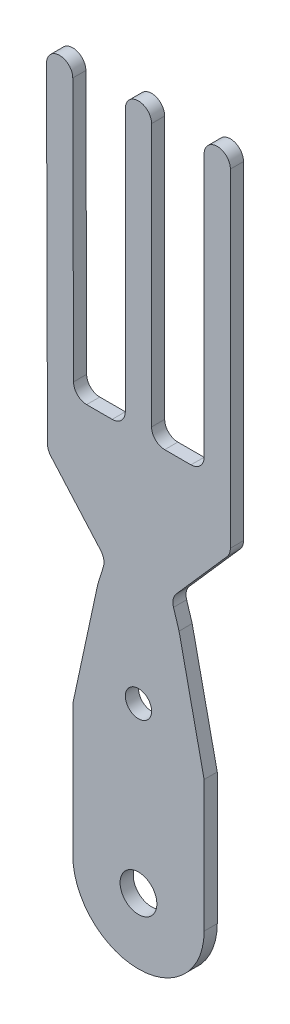
ISO-10303-21;
HEADER;
FILE_DESCRIPTION(('STEP AP214'),'2;1');
FILE_NAME('part.step','',(''),(''),'','','');
FILE_SCHEMA(('AUTOMOTIVE_DESIGN { 1 0 10303 214 1 1 1 1 }'));
ENDSEC;
DATA;
#1=APPLICATION_CONTEXT('core data for automotive mechanical design processes');
#2=APPLICATION_PROTOCOL_DEFINITION('international standard','automotive_design',2000,#1);
#3=PRODUCT_CONTEXT('',#1,'mechanical');
#4=PRODUCT('Part','Part','',(#3));
#5=PRODUCT_RELATED_PRODUCT_CATEGORY('part','',(#4));
#6=PRODUCT_DEFINITION_FORMATION('','',#4);
#7=PRODUCT_DEFINITION_CONTEXT('part definition',#1,'design');
#8=PRODUCT_DEFINITION('design','',#6,#7);
#9=PRODUCT_DEFINITION_SHAPE('','',#8);
#10=(LENGTH_UNIT() NAMED_UNIT(*) SI_UNIT(.MILLI.,.METRE.));
#11=(NAMED_UNIT(*) PLANE_ANGLE_UNIT() SI_UNIT($,.RADIAN.));
#12=(NAMED_UNIT(*) SI_UNIT($,.STERADIAN.) SOLID_ANGLE_UNIT());
#13=UNCERTAINTY_MEASURE_WITH_UNIT(LENGTH_MEASURE(1.E-05),#10,'distance_accuracy_value','');
#14=(GEOMETRIC_REPRESENTATION_CONTEXT(3) GLOBAL_UNCERTAINTY_ASSIGNED_CONTEXT((#13)) GLOBAL_UNIT_ASSIGNED_CONTEXT((#10,
#11,#12)) REPRESENTATION_CONTEXT('',''));
#15=CARTESIAN_POINT('',(0.,0.,0.));
#16=DIRECTION('',(0.,0.,1.));
#17=DIRECTION('',(1.,0.,0.));
#18=AXIS2_PLACEMENT_3D('',#15,#16,#17);
#19=CARTESIAN_POINT('',(51.2059903999994,33.8532621450006,-1.));
#20=DIRECTION('',(0.,0.,1.));
#21=DIRECTION('',(1.,0.,0.));
#22=AXIS2_PLACEMENT_3D('',#19,#20,#21);
#23=CYLINDRICAL_SURFACE('',#22,1.);
#24=CARTESIAN_POINT('',(51.2059903999994,33.8532621450006,0.));
#25=DIRECTION('',(0.,0.,1.));
#26=DIRECTION('',(1.,0.,0.));
#27=AXIS2_PLACEMENT_3D('',#24,#25,#26);
#28=CIRCLE('',#27,1.);
#29=CARTESIAN_POINT('',(52.2059903999994,33.8532621450006,0.));
#30=VERTEX_POINT('',#29);
#31=CARTESIAN_POINT('',(50.2059903999994,33.8532621450006,0.));
#32=VERTEX_POINT('',#31);
#33=EDGE_CURVE('E256',#30,#32,#28,.T.);
#34=ORIENTED_EDGE('',*,*,#33,.F.);
#35=DIRECTION('',(0.,0.,1.));
#36=VECTOR('',#35,1.);
#37=CARTESIAN_POINT('',(52.2059903999994,33.8532621450006,-1.));
#38=LINE('',#37,#36);
#39=CARTESIAN_POINT('',(52.2059903999994,33.8532621450006,-1.));
#40=VERTEX_POINT('',#39);
#41=EDGE_CURVE('E11',#40,#30,#38,.T.);
#42=ORIENTED_EDGE('',*,*,#41,.F.);
#43=CARTESIAN_POINT('',(51.2059903999994,33.8532621450006,-1.));
#44=DIRECTION('',(0.,0.,1.));
#45=DIRECTION('',(1.,0.,0.));
#46=AXIS2_PLACEMENT_3D('',#43,#44,#45);
#47=CIRCLE('',#46,1.);
#48=CARTESIAN_POINT('',(50.2059903999994,33.8532621450006,-1.));
#49=VERTEX_POINT('',#48);
#50=EDGE_CURVE('E337',#40,#49,#47,.T.);
#51=ORIENTED_EDGE('',*,*,#50,.T.);
#52=DIRECTION('',(0.,0.,1.));
#53=VECTOR('',#52,1.);
#54=CARTESIAN_POINT('',(50.2059903999994,33.8532621450006,-1.));
#55=LINE('',#54,#53);
#56=EDGE_CURVE('E42',#49,#32,#55,.T.);
#57=ORIENTED_EDGE('',*,*,#56,.T.);
#58=EDGE_LOOP('',(#34,#42,#51,#57));
#59=FACE_BOUND('',#58,.T.);
#60=ADVANCED_FACE('F39',(#59),#23,.T.);
#61=CARTESIAN_POINT('',(52.2059903999994,33.8532621450006,-1.));
#62=DIRECTION('',(1.,0.,0.));
#63=DIRECTION('',(0.,0.,-1.));
#64=AXIS2_PLACEMENT_3D('',#61,#62,#63);
#65=PLANE('',#64);
#66=DIRECTION('',(0.,1.,0.));
#67=VECTOR('',#66,1.);
#68=CARTESIAN_POINT('',(52.2059903999994,33.8532621450006,0.));
#69=LINE('',#68,#67);
#70=CARTESIAN_POINT('',(52.2059903999994,8.85490956684443,0.));
#71=VERTEX_POINT('',#70);
#72=EDGE_CURVE('E335',#71,#30,#69,.T.);
#73=ORIENTED_EDGE('',*,*,#72,.F.);
#74=DIRECTION('',(0.,0.,1.));
#75=VECTOR('',#74,1.);
#76=CARTESIAN_POINT('',(52.2059903999994,8.85490956684443,-1.));
#77=LINE('',#76,#75);
#78=CARTESIAN_POINT('',(52.2059903999994,8.85490956684443,-1.));
#79=VERTEX_POINT('',#78);
#80=EDGE_CURVE('E48',#79,#71,#77,.T.);
#81=ORIENTED_EDGE('',*,*,#80,.F.);
#82=DIRECTION('',(0.,1.,0.));
#83=VECTOR('',#82,1.);
#84=CARTESIAN_POINT('',(52.2059903999994,33.8532621450006,-1.));
#85=LINE('',#84,#83);
#86=EDGE_CURVE('E246',#79,#40,#85,.T.);
#87=ORIENTED_EDGE('',*,*,#86,.T.);
#88=ORIENTED_EDGE('',*,*,#41,.T.);
#89=EDGE_LOOP('',(#73,#81,#87,#88));
#90=FACE_BOUND('',#89,.T.);
#91=ADVANCED_FACE('F389',(#90),#65,.T.);
#92=CARTESIAN_POINT('',(51.171383471131,8.85490956684508,-1.));
#93=DIRECTION('',(0.,0.,1.));
#94=DIRECTION('',(1.,0.,0.));
#95=AXIS2_PLACEMENT_3D('',#92,#93,#94);
#96=CYLINDRICAL_SURFACE('',#95,1.03460692886839);
#97=CARTESIAN_POINT('',(51.171383471131,8.85490956684508,0.));
#98=DIRECTION('',(0.,0.,1.));
#99=DIRECTION('',(1.,0.,0.));
#100=AXIS2_PLACEMENT_3D('',#97,#98,#99);
#101=CIRCLE('',#100,1.03460692886839);
#102=CARTESIAN_POINT('',(51.948138548908,8.17148945709553,0.));
#103=VERTEX_POINT('',#102);
#104=EDGE_CURVE('E233',#103,#71,#101,.T.);
#105=ORIENTED_EDGE('',*,*,#104,.F.);
#106=DIRECTION('',(0.,0.,1.));
#107=VECTOR('',#106,1.);
#108=CARTESIAN_POINT('',(51.948138548908,8.17148945709553,-1.));
#109=LINE('',#108,#107);
#110=CARTESIAN_POINT('',(51.948138548908,8.17148945709553,-1.));
#111=VERTEX_POINT('',#110);
#112=EDGE_CURVE('E228',#111,#103,#109,.T.);
#113=ORIENTED_EDGE('',*,*,#112,.F.);
#114=CARTESIAN_POINT('',(51.171383471131,8.85490956684508,-1.));
#115=DIRECTION('',(0.,0.,1.));
#116=DIRECTION('',(1.,0.,0.));
#117=AXIS2_PLACEMENT_3D('',#114,#115,#116);
#118=CIRCLE('',#117,1.03460692886839);
#119=EDGE_CURVE('E231',#111,#79,#118,.T.);
#120=ORIENTED_EDGE('',*,*,#119,.T.);
#121=ORIENTED_EDGE('',*,*,#80,.T.);
#122=EDGE_LOOP('',(#105,#113,#120,#121));
#123=FACE_BOUND('',#122,.T.);
#124=ADVANCED_FACE('F230',(#123),#96,.T.);
#125=CARTESIAN_POINT('',(51.948138548908,8.17148945709553,-1.));
#126=DIRECTION('',(0.750773125622314,-0.660560151570847,0.));
#127=DIRECTION('',(0.660560151570847,0.750773125622314,0.));
#128=AXIS2_PLACEMENT_3D('',#125,#126,#127);
#129=PLANE('',#128);
#130=DIRECTION('',(0.660560151570847,0.750773125622314,0.));
#131=VECTOR('',#130,1.);
#132=CARTESIAN_POINT('',(51.948138548908,8.17148945709553,0.));
#133=LINE('',#132,#131);
#134=CARTESIAN_POINT('',(48.0874459509376,3.78354046872203,0.));
#135=VERTEX_POINT('',#134);
#136=EDGE_CURVE('E332',#135,#103,#133,.T.);
#137=ORIENTED_EDGE('',*,*,#136,.F.);
#138=DIRECTION('',(0.,0.,1.));
#139=VECTOR('',#138,1.);
#140=CARTESIAN_POINT('',(48.0874459509376,3.78354046872203,-1.));
#141=LINE('',#140,#139);
#142=CARTESIAN_POINT('',(48.0874459509376,3.78354046872203,-1.));
#143=VERTEX_POINT('',#142);
#144=EDGE_CURVE('E238',#143,#135,#141,.T.);
#145=ORIENTED_EDGE('',*,*,#144,.F.);
#146=DIRECTION('',(0.660560151570847,0.750773125622314,0.));
#147=VECTOR('',#146,1.);
#148=CARTESIAN_POINT('',(51.948138548908,8.17148945709553,-1.));
#149=LINE('',#148,#147);
#150=EDGE_CURVE('E244',#143,#111,#149,.T.);
#151=ORIENTED_EDGE('',*,*,#150,.T.);
#152=ORIENTED_EDGE('',*,*,#112,.T.);
#153=EDGE_LOOP('',(#137,#145,#151,#152));
#154=FACE_BOUND('',#153,.T.);
#155=ADVANCED_FACE('F248',(#154),#129,.T.);
#156=CARTESIAN_POINT('',(48.8642010287147,3.10012035897242,-1.));
#157=DIRECTION('',(0.,0.,1.));
#158=DIRECTION('',(1.,0.,0.));
#159=AXIS2_PLACEMENT_3D('',#156,#157,#158);
#160=CYLINDRICAL_SURFACE('',#159,1.03460692886847);
#161=CARTESIAN_POINT('',(48.8642010287147,3.10012035897242,0.));
#162=DIRECTION('',(0.,0.,-1.));
#163=DIRECTION('',(1.,0.,0.));
#164=AXIS2_PLACEMENT_3D('',#161,#162,#163);
#165=CIRCLE('',#164,1.03460692886847);
#166=CARTESIAN_POINT('',(47.8763878636981,2.79248965783455,0.));
#167=VERTEX_POINT('',#166);
#168=EDGE_CURVE('E329',#167,#135,#165,.T.);
#169=ORIENTED_EDGE('',*,*,#168,.F.);
#170=DIRECTION('',(0.,0.,1.));
#171=VECTOR('',#170,1.);
#172=CARTESIAN_POINT('',(47.8763878636981,2.79248965783455,-1.));
#173=LINE('',#172,#171);
#174=CARTESIAN_POINT('',(47.8763878636981,2.79248965783455,-1.));
#175=VERTEX_POINT('',#174);
#176=EDGE_CURVE('E341',#175,#167,#173,.T.);
#177=ORIENTED_EDGE('',*,*,#176,.F.);
#178=CARTESIAN_POINT('',(48.8642010287147,3.10012035897242,-1.));
#179=DIRECTION('',(0.,0.,-1.));
#180=DIRECTION('',(1.,0.,0.));
#181=AXIS2_PLACEMENT_3D('',#178,#179,#180);
#182=CIRCLE('',#181,1.03460692886847);
#183=EDGE_CURVE('E249',#175,#143,#182,.T.);
#184=ORIENTED_EDGE('',*,*,#183,.T.);
#185=ORIENTED_EDGE('',*,*,#144,.T.);
#186=EDGE_LOOP('',(#169,#177,#184,#185));
#187=FACE_BOUND('',#186,.T.);
#188=ADVANCED_FACE('F402',(#187),#160,.F.);
#189=CARTESIAN_POINT('',(47.8763878636981,2.79248965783455,-1.));
#190=DIRECTION('',(0.954771457114567,0.29734065426599,0.));
#191=DIRECTION('',(-0.29734065426599,0.954771457114567,0.));
#192=AXIS2_PLACEMENT_3D('',#189,#190,#191);
#193=PLANE('',#192);
#194=DIRECTION('',(-0.29734065426599,0.954771457114567,0.));
#195=VECTOR('',#194,1.);
#196=CARTESIAN_POINT('',(47.8763878636981,2.79248965783455,0.));
#197=LINE('',#196,#195);
#198=CARTESIAN_POINT('',(48.2987110169203,1.43639493419007,0.));
#199=VERTEX_POINT('',#198);
#200=EDGE_CURVE('E326',#199,#167,#197,.T.);
#201=ORIENTED_EDGE('',*,*,#200,.F.);
#202=DIRECTION('',(0.,0.,1.));
#203=VECTOR('',#202,1.);
#204=CARTESIAN_POINT('',(48.2987110169203,1.43639493419007,-1.));
#205=LINE('',#204,#203);
#206=CARTESIAN_POINT('',(48.2987110169203,1.43639493419007,-1.));
#207=VERTEX_POINT('',#206);
#208=EDGE_CURVE('E343',#207,#199,#205,.T.);
#209=ORIENTED_EDGE('',*,*,#208,.F.);
#210=DIRECTION('',(-0.29734065426599,0.954771457114567,0.));
#211=VECTOR('',#210,1.);
#212=CARTESIAN_POINT('',(47.8763878636981,2.79248965783455,-1.));
#213=LINE('',#212,#211);
#214=EDGE_CURVE('E251',#207,#175,#213,.T.);
#215=ORIENTED_EDGE('',*,*,#214,.T.);
#216=ORIENTED_EDGE('',*,*,#176,.T.);
#217=EDGE_LOOP('',(#201,#209,#215,#216));
#218=FACE_BOUND('',#217,.T.);
#219=ADVANCED_FACE('F405',(#218),#193,.T.);
#220=CARTESIAN_POINT('',(50.2074370744616,-7.3916991490481,-1.));
#221=DIRECTION('',(0.977415332722203,0.211327393774553,0.));
#222=DIRECTION('',(-0.211327393774553,0.977415332722203,0.));
#223=AXIS2_PLACEMENT_3D('',#220,#221,#222);
#224=PLANE('',#223);
#225=DIRECTION('',(-0.211327393774553,0.977415332722203,0.));
#226=VECTOR('',#225,1.);
#227=CARTESIAN_POINT('',(50.2074370744616,-7.3916991490481,0.));
#228=LINE('',#227,#226);
#229=CARTESIAN_POINT('',(50.2074370744616,-7.3916991490481,0.));
#230=VERTEX_POINT('',#229);
#231=EDGE_CURVE('E323',#230,#199,#228,.T.);
#232=ORIENTED_EDGE('',*,*,#231,.F.);
#233=DIRECTION('',(0.,0.,1.));
#234=VECTOR('',#233,1.);
#235=CARTESIAN_POINT('',(50.2074370744616,-7.3916991490481,-1.));
#236=LINE('',#235,#234);
#237=CARTESIAN_POINT('',(50.2074370744616,-7.3916991490481,-1.));
#238=VERTEX_POINT('',#237);
#239=EDGE_CURVE('E345',#238,#230,#236,.T.);
#240=ORIENTED_EDGE('',*,*,#239,.F.);
#241=DIRECTION('',(-0.211327393774553,0.977415332722203,0.));
#242=VECTOR('',#241,1.);
#243=CARTESIAN_POINT('',(50.2074370744616,-7.3916991490481,-1.));
#244=LINE('',#243,#242);
#245=EDGE_CURVE('E591',#238,#207,#244,.T.);
#246=ORIENTED_EDGE('',*,*,#245,.T.);
#247=ORIENTED_EDGE('',*,*,#208,.T.);
#248=EDGE_LOOP('',(#232,#240,#246,#247));
#249=FACE_BOUND('',#248,.T.);
#250=ADVANCED_FACE('F409',(#249),#224,.T.);
#251=CARTESIAN_POINT('',(50.2074370744616,-7.3916991490481,-1.));
#252=DIRECTION('',(0.999999990495723,0.000137871512091449,0.));
#253=DIRECTION('',(-0.000137871512091449,0.999999990495723,0.));
#254=AXIS2_PLACEMENT_3D('',#251,#252,#253);
#255=PLANE('',#254);
#256=DIRECTION('',(-0.000137871512091449,0.999999990495723,0.));
#257=VECTOR('',#256,1.);
#258=CARTESIAN_POINT('',(50.2074370744616,-7.3916991490481,0.));
#259=LINE('',#258,#257);
#260=CARTESIAN_POINT('',(50.208815979668,-17.393077769126,0.));
#261=VERTEX_POINT('',#260);
#262=EDGE_CURVE('E320',#261,#230,#259,.T.);
#263=ORIENTED_EDGE('',*,*,#262,.F.);
#264=DIRECTION('',(0.,0.,1.));
#265=VECTOR('',#264,1.);
#266=CARTESIAN_POINT('',(50.208815979668,-17.393077769126,-1.));
#267=LINE('',#266,#265);
#268=CARTESIAN_POINT('',(50.208815979668,-17.393077769126,-1.));
#269=VERTEX_POINT('',#268);
#270=EDGE_CURVE('E347',#269,#261,#267,.T.);
#271=ORIENTED_EDGE('',*,*,#270,.F.);
#272=DIRECTION('',(-0.000137871512091449,0.999999990495723,0.));
#273=VECTOR('',#272,1.);
#274=CARTESIAN_POINT('',(50.2074370744616,-7.3916991490481,-1.));
#275=LINE('',#274,#273);
#276=EDGE_CURVE('E588',#269,#238,#275,.T.);
#277=ORIENTED_EDGE('',*,*,#276,.T.);
#278=ORIENTED_EDGE('',*,*,#239,.T.);
#279=EDGE_LOOP('',(#263,#271,#277,#278));
#280=FACE_BOUND('',#279,.T.);
#281=ADVANCED_FACE('F413',(#280),#255,.T.);
#282=CARTESIAN_POINT('',(45.2088159321466,-17.393077769126,-1.));
#283=DIRECTION('',(0.,0.,1.));
#284=DIRECTION('',(1.,0.,0.));
#285=AXIS2_PLACEMENT_3D('',#282,#283,#284);
#286=CYLINDRICAL_SURFACE('',#285,5.00000004752139);
#287=CARTESIAN_POINT('',(45.2088159321466,-17.393077769126,0.));
#288=DIRECTION('',(0.,0.,1.));
#289=DIRECTION('',(1.,0.,0.));
#290=AXIS2_PLACEMENT_3D('',#287,#288,#289);
#291=CIRCLE('',#290,5.00000004752139);
#292=CARTESIAN_POINT('',(40.2088158846253,-17.393077769126,0.));
#293=VERTEX_POINT('',#292);
#294=EDGE_CURVE('E317',#293,#261,#291,.T.);
#295=ORIENTED_EDGE('',*,*,#294,.F.);
#296=DIRECTION('',(0.,0.,1.));
#297=VECTOR('',#296,1.);
#298=CARTESIAN_POINT('',(40.2088158846253,-17.393077769126,-1.));
#299=LINE('',#298,#297);
#300=CARTESIAN_POINT('',(40.2088158846253,-17.393077769126,-1.));
#301=VERTEX_POINT('',#300);
#302=EDGE_CURVE('E349',#301,#293,#299,.T.);
#303=ORIENTED_EDGE('',*,*,#302,.F.);
#304=CARTESIAN_POINT('',(45.2088159321466,-17.393077769126,-1.));
#305=DIRECTION('',(0.,0.,1.));
#306=DIRECTION('',(1.,0.,0.));
#307=AXIS2_PLACEMENT_3D('',#304,#305,#306);
#308=CIRCLE('',#307,5.00000004752139);
#309=EDGE_CURVE('E585',#301,#269,#308,.T.);
#310=ORIENTED_EDGE('',*,*,#309,.T.);
#311=ORIENTED_EDGE('',*,*,#270,.T.);
#312=EDGE_LOOP('',(#295,#303,#310,#311));
#313=FACE_BOUND('',#312,.T.);
#314=ADVANCED_FACE('F417',(#313),#286,.T.);
#315=CARTESIAN_POINT('',(40.2074371695043,-7.39307786416881,-1.));
#316=DIRECTION('',(-0.999999990495723,-0.00013787151209102,0.));
#317=DIRECTION('',(0.00013787151209102,-0.999999990495723,0.));
#318=AXIS2_PLACEMENT_3D('',#315,#316,#317);
#319=PLANE('',#318);
#320=DIRECTION('',(0.00013787151209102,-0.999999990495723,0.));
#321=VECTOR('',#320,1.);
#322=CARTESIAN_POINT('',(40.2074371695043,-7.39307786416881,0.));
#323=LINE('',#322,#321);
#324=CARTESIAN_POINT('',(40.2074371695043,-7.39307786416881,0.));
#325=VERTEX_POINT('',#324);
#326=EDGE_CURVE('E314',#325,#293,#323,.T.);
#327=ORIENTED_EDGE('',*,*,#326,.F.);
#328=DIRECTION('',(0.,0.,1.));
#329=VECTOR('',#328,1.);
#330=CARTESIAN_POINT('',(40.2074371695043,-7.39307786416881,-1.));
#331=LINE('',#330,#329);
#332=CARTESIAN_POINT('',(40.2074371695043,-7.39307786416881,-1.));
#333=VERTEX_POINT('',#332);
#334=EDGE_CURVE('E351',#333,#325,#331,.T.);
#335=ORIENTED_EDGE('',*,*,#334,.F.);
#336=DIRECTION('',(0.00013787151209102,-0.999999990495723,0.));
#337=VECTOR('',#336,1.);
#338=CARTESIAN_POINT('',(40.2074371695043,-7.39307786416881,-1.));
#339=LINE('',#338,#337);
#340=EDGE_CURVE('E582',#333,#301,#339,.T.);
#341=ORIENTED_EDGE('',*,*,#340,.T.);
#342=ORIENTED_EDGE('',*,*,#302,.T.);
#343=EDGE_LOOP('',(#327,#335,#341,#342));
#344=FACE_BOUND('',#343,.T.);
#345=ADVANCED_FACE('F421',(#344),#319,.T.);
#346=CARTESIAN_POINT('',(40.2074371695043,-7.39307786416881,-1.));
#347=DIRECTION('',(-0.977518656205865,0.210848943012482,0.));
#348=DIRECTION('',(-0.210848943012482,-0.977518656205865,0.));
#349=AXIS2_PLACEMENT_3D('',#346,#347,#348);
#350=PLANE('',#349);
#351=DIRECTION('',(-0.210848943012482,-0.977518656205865,0.));
#352=VECTOR('',#351,1.);
#353=CARTESIAN_POINT('',(40.2074371695043,-7.39307786416881,0.));
#354=LINE('',#353,#352);
#355=CARTESIAN_POINT('',(42.1119841954728,1.43660950777743,0.));
#356=VERTEX_POINT('',#355);
#357=EDGE_CURVE('E311',#356,#325,#354,.T.);
#358=ORIENTED_EDGE('',*,*,#357,.F.);
#359=DIRECTION('',(0.,0.,1.));
#360=VECTOR('',#359,1.);
#361=CARTESIAN_POINT('',(42.1119841954728,1.43660950777743,-1.));
#362=LINE('',#361,#360);
#363=CARTESIAN_POINT('',(42.1119841954728,1.43660950777743,-1.));
#364=VERTEX_POINT('',#363);
#365=EDGE_CURVE('E353',#364,#356,#362,.T.);
#366=ORIENTED_EDGE('',*,*,#365,.F.);
#367=DIRECTION('',(-0.210848943012482,-0.977518656205865,0.));
#368=VECTOR('',#367,1.);
#369=CARTESIAN_POINT('',(40.2074371695043,-7.39307786416881,-1.));
#370=LINE('',#369,#368);
#371=EDGE_CURVE('E579',#364,#333,#370,.T.);
#372=ORIENTED_EDGE('',*,*,#371,.T.);
#373=ORIENTED_EDGE('',*,*,#334,.T.);
#374=EDGE_LOOP('',(#358,#366,#372,#373));
#375=FACE_BOUND('',#374,.T.);
#376=ADVANCED_FACE('F425',(#375),#350,.T.);
#377=CARTESIAN_POINT('',(42.1119841954728,1.43660950777743,-1.));
#378=DIRECTION('',(-0.954620384528614,0.297825320351446,0.));
#379=DIRECTION('',(-0.297825320351446,-0.954620384528614,0.));
#380=AXIS2_PLACEMENT_3D('',#377,#378,#379);
#381=PLANE('',#380);
#382=DIRECTION('',(-0.297825320351446,-0.954620384528614,0.));
#383=VECTOR('',#382,1.);
#384=CARTESIAN_POINT('',(42.1119841954728,1.43660950777743,0.));
#385=LINE('',#384,#383);
#386=CARTESIAN_POINT('',(42.5349957365979,2.79248965783455,0.));
#387=VERTEX_POINT('',#386);
#388=EDGE_CURVE('E308',#387,#356,#385,.T.);
#389=ORIENTED_EDGE('',*,*,#388,.F.);
#390=DIRECTION('',(0.,0.,1.));
#391=VECTOR('',#390,1.);
#392=CARTESIAN_POINT('',(42.5349957365979,2.79248965783455,-1.));
#393=LINE('',#392,#391);
#394=CARTESIAN_POINT('',(42.5349957365979,2.79248965783455,-1.));
#395=VERTEX_POINT('',#394);
#396=EDGE_CURVE('E355',#395,#387,#393,.T.);
#397=ORIENTED_EDGE('',*,*,#396,.F.);
#398=DIRECTION('',(-0.297825320351446,-0.954620384528614,0.));
#399=VECTOR('',#398,1.);
#400=CARTESIAN_POINT('',(42.1119841954728,1.43660950777743,-1.));
#401=LINE('',#400,#399);
#402=EDGE_CURVE('E576',#395,#364,#401,.T.);
#403=ORIENTED_EDGE('',*,*,#402,.T.);
#404=ORIENTED_EDGE('',*,*,#365,.T.);
#405=EDGE_LOOP('',(#389,#397,#403,#404));
#406=FACE_BOUND('',#405,.T.);
#407=ADVANCED_FACE('F429',(#406),#381,.T.);
#408=CARTESIAN_POINT('',(41.5473388723256,3.10062179786261,-1.));
#409=DIRECTION('',(0.,0.,1.));
#410=DIRECTION('',(1.,0.,0.));
#411=AXIS2_PLACEMENT_3D('',#408,#409,#410);
#412=CYLINDRICAL_SURFACE('',#411,1.03460692886838);
#413=CARTESIAN_POINT('',(41.5473388723256,3.10062179786261,0.));
#414=DIRECTION('',(0.,0.,-1.));
#415=DIRECTION('',(1.,0.,0.));
#416=AXIS2_PLACEMENT_3D('',#413,#414,#415);
#417=CIRCLE('',#416,1.03460692886838);
#418=CARTESIAN_POINT('',(42.3245348490612,3.78354046872202,0.));
#419=VERTEX_POINT('',#418);
#420=EDGE_CURVE('E305',#419,#387,#417,.T.);
#421=ORIENTED_EDGE('',*,*,#420,.F.);
#422=DIRECTION('',(0.,0.,1.));
#423=VECTOR('',#422,1.);
#424=CARTESIAN_POINT('',(42.3245348490612,3.78354046872202,-1.));
#425=LINE('',#424,#423);
#426=CARTESIAN_POINT('',(42.3245348490612,3.78354046872202,-1.));
#427=VERTEX_POINT('',#426);
#428=EDGE_CURVE('E357',#427,#419,#425,.T.);
#429=ORIENTED_EDGE('',*,*,#428,.F.);
#430=CARTESIAN_POINT('',(41.5473388723256,3.10062179786261,-1.));
#431=DIRECTION('',(0.,0.,-1.));
#432=DIRECTION('',(1.,0.,0.));
#433=AXIS2_PLACEMENT_3D('',#430,#431,#432);
#434=CIRCLE('',#433,1.03460692886838);
#435=EDGE_CURVE('E573',#427,#395,#434,.T.);
#436=ORIENTED_EDGE('',*,*,#435,.T.);
#437=ORIENTED_EDGE('',*,*,#396,.T.);
#438=EDGE_LOOP('',(#421,#429,#436,#437));
#439=FACE_BOUND('',#438,.T.);
#440=ADVANCED_FACE('F433',(#439),#412,.F.);
#441=CARTESIAN_POINT('',(42.3245348490612,3.78354046872202,-1.));
#442=DIRECTION('',(-0.751199276797535,-0.660075485485457,0.));
#443=DIRECTION('',(0.660075485485457,-0.751199276797535,0.));
#444=AXIS2_PLACEMENT_3D('',#441,#442,#443);
#445=PLANE('',#444);
#446=DIRECTION('',(0.660075485485457,-0.751199276797534,0.));
#447=VECTOR('',#446,1.);
#448=CARTESIAN_POINT('',(42.3245348490612,3.78354046872202,0.));
#449=LINE('',#448,#447);
#450=CARTESIAN_POINT('',(38.5335975802165,8.09781875561613,0.));
#451=VERTEX_POINT('',#450);
#452=EDGE_CURVE('E302',#451,#419,#449,.T.);
#453=ORIENTED_EDGE('',*,*,#452,.F.);
#454=DIRECTION('',(0.,0.,1.));
#455=VECTOR('',#454,1.);
#456=CARTESIAN_POINT('',(38.5335975802165,8.09781875561613,-1.));
#457=LINE('',#456,#455);
#458=CARTESIAN_POINT('',(38.5335975802165,8.09781875561613,-1.));
#459=VERTEX_POINT('',#458);
#460=EDGE_CURVE('E359',#459,#451,#457,.T.);
#461=ORIENTED_EDGE('',*,*,#460,.F.);
#462=DIRECTION('',(0.660075485485457,-0.751199276797534,0.));
#463=VECTOR('',#462,1.);
#464=CARTESIAN_POINT('',(42.3245348490612,3.78354046872202,-1.));
#465=LINE('',#464,#463);
#466=EDGE_CURVE('E570',#459,#427,#465,.T.);
#467=ORIENTED_EDGE('',*,*,#466,.T.);
#468=ORIENTED_EDGE('',*,*,#428,.T.);
#469=EDGE_LOOP('',(#453,#461,#467,#468));
#470=FACE_BOUND('',#469,.T.);
#471=ADVANCED_FACE('F437',(#470),#445,.T.);
#472=CARTESIAN_POINT('',(39.3107935569522,8.78073742647555,-1.));
#473=DIRECTION('',(0.,0.,1.));
#474=DIRECTION('',(1.,0.,0.));
#475=AXIS2_PLACEMENT_3D('',#472,#473,#474);
#476=CYLINDRICAL_SURFACE('',#475,1.03460692886839);
#477=CARTESIAN_POINT('',(39.3107935569522,8.78073742647555,0.));
#478=DIRECTION('',(0.,0.,1.));
#479=DIRECTION('',(1.,0.,0.));
#480=AXIS2_PLACEMENT_3D('',#477,#478,#479);
#481=CIRCLE('',#480,1.03460692886839);
#482=CARTESIAN_POINT('',(38.2788487954191,8.85490956684442,0.));
#483=VERTEX_POINT('',#482);
#484=EDGE_CURVE('E299',#483,#451,#481,.T.);
#485=ORIENTED_EDGE('',*,*,#484,.F.);
#486=DIRECTION('',(0.,0.,1.));
#487=VECTOR('',#486,1.);
#488=CARTESIAN_POINT('',(38.2788487954191,8.85490956684442,-1.));
#489=LINE('',#488,#487);
#490=CARTESIAN_POINT('',(38.2788487954191,8.85490956684442,-1.));
#491=VERTEX_POINT('',#490);
#492=EDGE_CURVE('E361',#491,#483,#489,.T.);
#493=ORIENTED_EDGE('',*,*,#492,.F.);
#494=CARTESIAN_POINT('',(39.3107935569522,8.78073742647555,-1.));
#495=DIRECTION('',(0.,0.,1.));
#496=DIRECTION('',(1.,0.,0.));
#497=AXIS2_PLACEMENT_3D('',#494,#495,#496);
#498=CIRCLE('',#497,1.03460692886839);
#499=EDGE_CURVE('E567',#491,#459,#498,.T.);
#500=ORIENTED_EDGE('',*,*,#499,.T.);
#501=ORIENTED_EDGE('',*,*,#460,.T.);
#502=EDGE_LOOP('',(#485,#493,#500,#501));
#503=FACE_BOUND('',#502,.T.);
#504=ADVANCED_FACE('F441',(#503),#476,.T.);
#505=CARTESIAN_POINT('',(38.2059903999995,33.8532621450006,-1.));
#506=DIRECTION('',(-0.999995752790691,-0.0029145154964482,0.));
#507=DIRECTION('',(0.0029145154964482,-0.999995752790691,0.));
#508=AXIS2_PLACEMENT_3D('',#505,#506,#507);
#509=PLANE('',#508);
#510=DIRECTION('',(0.0029145154964482,-0.999995752790691,0.));
#511=VECTOR('',#510,1.);
#512=CARTESIAN_POINT('',(38.2059903999995,33.8532621450006,0.));
#513=LINE('',#512,#511);
#514=CARTESIAN_POINT('',(38.2059903999995,33.8532621450006,0.));
#515=VERTEX_POINT('',#514);
#516=EDGE_CURVE('E296',#515,#483,#513,.T.);
#517=ORIENTED_EDGE('',*,*,#516,.F.);
#518=DIRECTION('',(0.,0.,1.));
#519=VECTOR('',#518,1.);
#520=CARTESIAN_POINT('',(38.2059903999995,33.8532621450006,-1.));
#521=LINE('',#520,#519);
#522=CARTESIAN_POINT('',(38.2059903999995,33.8532621450006,-1.));
#523=VERTEX_POINT('',#522);
#524=EDGE_CURVE('E363',#523,#515,#521,.T.);
#525=ORIENTED_EDGE('',*,*,#524,.F.);
#526=DIRECTION('',(0.0029145154964482,-0.999995752790691,0.));
#527=VECTOR('',#526,1.);
#528=CARTESIAN_POINT('',(38.2059903999995,33.8532621450006,-1.));
#529=LINE('',#528,#527);
#530=EDGE_CURVE('E564',#523,#491,#529,.T.);
#531=ORIENTED_EDGE('',*,*,#530,.T.);
#532=ORIENTED_EDGE('',*,*,#492,.T.);
#533=EDGE_LOOP('',(#517,#525,#531,#532));
#534=FACE_BOUND('',#533,.T.);
#535=ADVANCED_FACE('F445',(#534),#509,.T.);
#536=CARTESIAN_POINT('',(39.2059988924921,33.8532621450006,-1.));
#537=DIRECTION('',(0.,0.,1.));
#538=DIRECTION('',(1.,0.,0.));
#539=AXIS2_PLACEMENT_3D('',#536,#537,#538);
#540=CYLINDRICAL_SURFACE('',#539,1.00000849249259);
#541=CARTESIAN_POINT('',(39.2059988924921,33.8532621450006,0.));
#542=DIRECTION('',(0.,0.,1.));
#543=DIRECTION('',(1.,0.,0.));
#544=AXIS2_PLACEMENT_3D('',#541,#542,#543);
#545=CIRCLE('',#544,1.00000849249259);
#546=CARTESIAN_POINT('',(40.2059903999995,33.8590905213051,0.));
#547=VERTEX_POINT('',#546);
#548=EDGE_CURVE('E293',#547,#515,#545,.T.);
#549=ORIENTED_EDGE('',*,*,#548,.F.);
#550=DIRECTION('',(0.,0.,1.));
#551=VECTOR('',#550,1.);
#552=CARTESIAN_POINT('',(40.2059903999995,33.8590905213051,-1.));
#553=LINE('',#552,#551);
#554=CARTESIAN_POINT('',(40.2059903999995,33.8590905213051,-1.));
#555=VERTEX_POINT('',#554);
#556=EDGE_CURVE('E365',#555,#547,#553,.T.);
#557=ORIENTED_EDGE('',*,*,#556,.F.);
#558=CARTESIAN_POINT('',(39.2059988924921,33.8532621450006,-1.));
#559=DIRECTION('',(0.,0.,1.));
#560=DIRECTION('',(1.,0.,0.));
#561=AXIS2_PLACEMENT_3D('',#558,#559,#560);
#562=CIRCLE('',#561,1.00000849249259);
#563=EDGE_CURVE('E561',#555,#523,#562,.T.);
#564=ORIENTED_EDGE('',*,*,#563,.T.);
#565=ORIENTED_EDGE('',*,*,#524,.T.);
#566=EDGE_LOOP('',(#549,#557,#564,#565));
#567=FACE_BOUND('',#566,.T.);
#568=ADVANCED_FACE('F449',(#567),#540,.T.);
#569=CARTESIAN_POINT('',(40.2642996504336,13.8503445557533,-1.));
#570=DIRECTION('',(0.999995753780752,0.00291417577796553,0.));
#571=DIRECTION('',(-0.00291417577796553,0.999995753780752,0.));
#572=AXIS2_PLACEMENT_3D('',#569,#570,#571);
#573=PLANE('',#572);
#574=DIRECTION('',(-0.00291417577796553,0.999995753780752,0.));
#575=VECTOR('',#574,1.);
#576=CARTESIAN_POINT('',(40.2642996504336,13.8503445557533,0.));
#577=LINE('',#576,#575);
#578=CARTESIAN_POINT('',(40.2642996504336,13.8503445557533,0.));
#579=VERTEX_POINT('',#578);
#580=EDGE_CURVE('E290',#579,#547,#577,.T.);
#581=ORIENTED_EDGE('',*,*,#580,.F.);
#582=DIRECTION('',(0.,0.,1.));
#583=VECTOR('',#582,1.);
#584=CARTESIAN_POINT('',(40.2642996504336,13.8503445557533,-1.));
#585=LINE('',#584,#583);
#586=CARTESIAN_POINT('',(40.2642996504336,13.8503445557533,-1.));
#587=VERTEX_POINT('',#586);
#588=EDGE_CURVE('E367',#587,#579,#585,.T.);
#589=ORIENTED_EDGE('',*,*,#588,.F.);
#590=DIRECTION('',(-0.00291417577796553,0.999995753780752,0.));
#591=VECTOR('',#590,1.);
#592=CARTESIAN_POINT('',(40.2642996504336,13.8503445557533,-1.));
#593=LINE('',#592,#591);
#594=EDGE_CURVE('E558',#587,#555,#593,.T.);
#595=ORIENTED_EDGE('',*,*,#594,.T.);
#596=ORIENTED_EDGE('',*,*,#556,.T.);
#597=EDGE_LOOP('',(#581,#589,#595,#596));
#598=FACE_BOUND('',#597,.T.);
#599=ADVANCED_FACE('F453',(#598),#573,.T.);
#600=CARTESIAN_POINT('',(41.2642954042144,13.8532587315312,-1.));
#601=DIRECTION('',(0.,0.,1.));
#602=DIRECTION('',(1.,0.,0.));
#603=AXIS2_PLACEMENT_3D('',#600,#601,#602);
#604=CYLINDRICAL_SURFACE('',#603,0.99999999999999);
#605=CARTESIAN_POINT('',(41.2642954042144,13.8532587315312,0.));
#606=DIRECTION('',(0.,0.,-1.));
#607=DIRECTION('',(-1.,0.,0.));
#608=AXIS2_PLACEMENT_3D('',#605,#606,#607);
#609=CIRCLE('',#608,0.99999999999999);
#610=CARTESIAN_POINT('',(41.2616825653143,12.8532621450006,0.));
#611=VERTEX_POINT('',#610);
#612=EDGE_CURVE('E287',#611,#579,#609,.T.);
#613=ORIENTED_EDGE('',*,*,#612,.F.);
#614=DIRECTION('',(0.,0.,1.));
#615=VECTOR('',#614,1.);
#616=CARTESIAN_POINT('',(41.2616825653143,12.8532621450006,-1.));
#617=LINE('',#616,#615);
#618=CARTESIAN_POINT('',(41.2616825653143,12.8532621450006,-1.));
#619=VERTEX_POINT('',#618);
#620=EDGE_CURVE('E369',#619,#611,#617,.T.);
#621=ORIENTED_EDGE('',*,*,#620,.F.);
#622=CARTESIAN_POINT('',(41.2642954042144,13.8532587315312,-1.));
#623=DIRECTION('',(0.,0.,-1.));
#624=DIRECTION('',(-1.,0.,0.));
#625=AXIS2_PLACEMENT_3D('',#622,#623,#624);
#626=CIRCLE('',#625,0.99999999999999);
#627=EDGE_CURVE('E555',#619,#587,#626,.T.);
#628=ORIENTED_EDGE('',*,*,#627,.T.);
#629=ORIENTED_EDGE('',*,*,#588,.T.);
#630=EDGE_LOOP('',(#613,#621,#628,#629));
#631=FACE_BOUND('',#630,.T.);
#632=ADVANCED_FACE('F457',(#631),#604,.F.);
#633=CARTESIAN_POINT('',(41.2616825653143,12.8532621450006,-1.));
#634=DIRECTION('',(0.,1.,0.));
#635=DIRECTION('',(0.,0.,1.));
#636=AXIS2_PLACEMENT_3D('',#633,#634,#635);
#637=PLANE('',#636);
#638=DIRECTION('',(-1.,0.,0.));
#639=VECTOR('',#638,1.);
#640=CARTESIAN_POINT('',(41.2616825653143,12.8532621450006,0.));
#641=LINE('',#640,#639);
#642=CARTESIAN_POINT('',(43.2059903999995,12.8532621450006,0.));
#643=VERTEX_POINT('',#642);
#644=EDGE_CURVE('E284',#643,#611,#641,.T.);
#645=ORIENTED_EDGE('',*,*,#644,.F.);
#646=DIRECTION('',(0.,0.,1.));
#647=VECTOR('',#646,1.);
#648=CARTESIAN_POINT('',(43.2059903999995,12.8532621450006,-1.));
#649=LINE('',#648,#647);
#650=CARTESIAN_POINT('',(43.2059903999995,12.8532621450006,-1.));
#651=VERTEX_POINT('',#650);
#652=EDGE_CURVE('E371',#651,#643,#649,.T.);
#653=ORIENTED_EDGE('',*,*,#652,.F.);
#654=DIRECTION('',(-1.,0.,0.));
#655=VECTOR('',#654,1.);
#656=CARTESIAN_POINT('',(41.2616825653143,12.8532621450006,-1.));
#657=LINE('',#656,#655);
#658=EDGE_CURVE('E552',#651,#619,#657,.T.);
#659=ORIENTED_EDGE('',*,*,#658,.T.);
#660=ORIENTED_EDGE('',*,*,#620,.T.);
#661=EDGE_LOOP('',(#645,#653,#659,#660));
#662=FACE_BOUND('',#661,.T.);
#663=ADVANCED_FACE('F461',(#662),#637,.T.);
#664=CARTESIAN_POINT('',(43.2059903999995,13.8532621450006,-1.));
#665=DIRECTION('',(0.,0.,1.));
#666=DIRECTION('',(1.,0.,0.));
#667=AXIS2_PLACEMENT_3D('',#664,#665,#666);
#668=CYLINDRICAL_SURFACE('',#667,1.00000000000001);
#669=CARTESIAN_POINT('',(43.2059903999995,13.8532621450006,0.));
#670=DIRECTION('',(0.,0.,-1.));
#671=DIRECTION('',(-1.,0.,0.));
#672=AXIS2_PLACEMENT_3D('',#669,#670,#671);
#673=CIRCLE('',#672,1.00000000000001);
#674=CARTESIAN_POINT('',(44.2059903999995,13.8532621450006,0.));
#675=VERTEX_POINT('',#674);
#676=EDGE_CURVE('E281',#675,#643,#673,.T.);
#677=ORIENTED_EDGE('',*,*,#676,.F.);
#678=DIRECTION('',(0.,0.,1.));
#679=VECTOR('',#678,1.);
#680=CARTESIAN_POINT('',(44.2059903999995,13.8532621450006,-1.));
#681=LINE('',#680,#679);
#682=CARTESIAN_POINT('',(44.2059903999995,13.8532621450006,-1.));
#683=VERTEX_POINT('',#682);
#684=EDGE_CURVE('E373',#683,#675,#681,.T.);
#685=ORIENTED_EDGE('',*,*,#684,.F.);
#686=CARTESIAN_POINT('',(43.2059903999995,13.8532621450006,-1.));
#687=DIRECTION('',(0.,0.,-1.));
#688=DIRECTION('',(-1.,0.,0.));
#689=AXIS2_PLACEMENT_3D('',#686,#687,#688);
#690=CIRCLE('',#689,1.00000000000001);
#691=EDGE_CURVE('E549',#683,#651,#690,.T.);
#692=ORIENTED_EDGE('',*,*,#691,.T.);
#693=ORIENTED_EDGE('',*,*,#652,.T.);
#694=EDGE_LOOP('',(#677,#685,#692,#693));
#695=FACE_BOUND('',#694,.T.);
#696=ADVANCED_FACE('F465',(#695),#668,.F.);
#697=CARTESIAN_POINT('',(44.2059903999994,33.8532621450006,-1.));
#698=DIRECTION('',(-1.,0.,0.));
#699=DIRECTION('',(0.,-1.,0.));
#700=AXIS2_PLACEMENT_3D('',#697,#698,#699);
#701=PLANE('',#700);
#702=DIRECTION('',(0.,-1.,0.));
#703=VECTOR('',#702,1.);
#704=CARTESIAN_POINT('',(44.2059903999994,33.8532621450006,0.));
#705=LINE('',#704,#703);
#706=CARTESIAN_POINT('',(44.2059903999994,33.8532621450006,0.));
#707=VERTEX_POINT('',#706);
#708=EDGE_CURVE('E278',#707,#675,#705,.T.);
#709=ORIENTED_EDGE('',*,*,#708,.F.);
#710=DIRECTION('',(0.,0.,1.));
#711=VECTOR('',#710,1.);
#712=CARTESIAN_POINT('',(44.2059903999994,33.8532621450006,-1.));
#713=LINE('',#712,#711);
#714=CARTESIAN_POINT('',(44.2059903999994,33.8532621450006,-1.));
#715=VERTEX_POINT('',#714);
#716=EDGE_CURVE('E375',#715,#707,#713,.T.);
#717=ORIENTED_EDGE('',*,*,#716,.F.);
#718=DIRECTION('',(0.,-1.,0.));
#719=VECTOR('',#718,1.);
#720=CARTESIAN_POINT('',(44.2059903999994,33.8532621450006,-1.));
#721=LINE('',#720,#719);
#722=EDGE_CURVE('E546',#715,#683,#721,.T.);
#723=ORIENTED_EDGE('',*,*,#722,.T.);
#724=ORIENTED_EDGE('',*,*,#684,.T.);
#725=EDGE_LOOP('',(#709,#717,#723,#724));
#726=FACE_BOUND('',#725,.T.);
#727=ADVANCED_FACE('F469',(#726),#701,.T.);
#728=CARTESIAN_POINT('',(45.2059903999994,33.8532621450006,-1.));
#729=DIRECTION('',(0.,0.,1.));
#730=DIRECTION('',(1.,0.,0.));
#731=AXIS2_PLACEMENT_3D('',#728,#729,#730);
#732=CYLINDRICAL_SURFACE('',#731,1.00000000000007);
#733=CARTESIAN_POINT('',(45.2059903999994,33.8532621450006,0.));
#734=DIRECTION('',(0.,0.,1.));
#735=DIRECTION('',(1.,0.,0.));
#736=AXIS2_PLACEMENT_3D('',#733,#734,#735);
#737=CIRCLE('',#736,1.00000000000007);
#738=CARTESIAN_POINT('',(46.2059903999995,33.8532621450006,0.));
#739=VERTEX_POINT('',#738);
#740=EDGE_CURVE('E275',#739,#707,#737,.T.);
#741=ORIENTED_EDGE('',*,*,#740,.F.);
#742=DIRECTION('',(0.,0.,1.));
#743=VECTOR('',#742,1.);
#744=CARTESIAN_POINT('',(46.2059903999995,33.8532621450006,-1.));
#745=LINE('',#744,#743);
#746=CARTESIAN_POINT('',(46.2059903999995,33.8532621450006,-1.));
#747=VERTEX_POINT('',#746);
#748=EDGE_CURVE('E377',#747,#739,#745,.T.);
#749=ORIENTED_EDGE('',*,*,#748,.F.);
#750=CARTESIAN_POINT('',(45.2059903999994,33.8532621450006,-1.));
#751=DIRECTION('',(0.,0.,1.));
#752=DIRECTION('',(1.,0.,0.));
#753=AXIS2_PLACEMENT_3D('',#750,#751,#752);
#754=CIRCLE('',#753,1.00000000000007);
#755=EDGE_CURVE('E543',#747,#715,#754,.T.);
#756=ORIENTED_EDGE('',*,*,#755,.T.);
#757=ORIENTED_EDGE('',*,*,#716,.T.);
#758=EDGE_LOOP('',(#741,#749,#756,#757));
#759=FACE_BOUND('',#758,.T.);
#760=ADVANCED_FACE('F473',(#759),#732,.T.);
#761=CARTESIAN_POINT('',(46.2059903999995,33.8532621450006,-1.));
#762=DIRECTION('',(1.,0.,0.));
#763=DIRECTION('',(0.,1.,0.));
#764=AXIS2_PLACEMENT_3D('',#761,#762,#763);
#765=PLANE('',#764);
#766=DIRECTION('',(0.,1.,0.));
#767=VECTOR('',#766,1.);
#768=CARTESIAN_POINT('',(46.2059903999995,33.8532621450006,0.));
#769=LINE('',#768,#767);
#770=CARTESIAN_POINT('',(46.2059903999995,13.8517101319897,0.));
#771=VERTEX_POINT('',#770);
#772=EDGE_CURVE('E272',#771,#739,#769,.T.);
#773=ORIENTED_EDGE('',*,*,#772,.F.);
#774=DIRECTION('',(0.,0.,1.));
#775=VECTOR('',#774,1.);
#776=CARTESIAN_POINT('',(46.2059903999995,13.8517101319897,-1.));
#777=LINE('',#776,#775);
#778=CARTESIAN_POINT('',(46.2059903999995,13.8517101319897,-1.));
#779=VERTEX_POINT('',#778);
#780=EDGE_CURVE('E379',#779,#771,#777,.T.);
#781=ORIENTED_EDGE('',*,*,#780,.F.);
#782=DIRECTION('',(0.,1.,0.));
#783=VECTOR('',#782,1.);
#784=CARTESIAN_POINT('',(46.2059903999995,33.8532621450006,-1.));
#785=LINE('',#784,#783);
#786=EDGE_CURVE('E540',#779,#747,#785,.T.);
#787=ORIENTED_EDGE('',*,*,#786,.T.);
#788=ORIENTED_EDGE('',*,*,#748,.T.);
#789=EDGE_LOOP('',(#773,#781,#787,#788));
#790=FACE_BOUND('',#789,.T.);
#791=ADVANCED_FACE('F477',(#790),#765,.T.);
#792=CARTESIAN_POINT('',(47.2059892009185,13.8532587315312,-1.));
#793=DIRECTION('',(0.,0.,1.));
#794=DIRECTION('',(1.,0.,0.));
#795=AXIS2_PLACEMENT_3D('',#792,#793,#794);
#796=CYLINDRICAL_SURFACE('',#795,1.00000000000001);
#797=CARTESIAN_POINT('',(47.2059892009185,13.8532587315312,0.));
#798=DIRECTION('',(0.,0.,-1.));
#799=DIRECTION('',(-1.,0.,0.));
#800=AXIS2_PLACEMENT_3D('',#797,#798,#799);
#801=CIRCLE('',#800,1.00000000000001);
#802=CARTESIAN_POINT('',(47.2059892009185,12.8532587315312,0.));
#803=VERTEX_POINT('',#802);
#804=EDGE_CURVE('E269',#803,#771,#801,.T.);
#805=ORIENTED_EDGE('',*,*,#804,.F.);
#806=DIRECTION('',(0.,0.,1.));
#807=VECTOR('',#806,1.);
#808=CARTESIAN_POINT('',(47.2059892009185,12.8532587315312,-1.));
#809=LINE('',#808,#807);
#810=CARTESIAN_POINT('',(47.2059892009185,12.8532587315312,-1.));
#811=VERTEX_POINT('',#810);
#812=EDGE_CURVE('E381',#811,#803,#809,.T.);
#813=ORIENTED_EDGE('',*,*,#812,.F.);
#814=CARTESIAN_POINT('',(47.2059892009185,13.8532587315312,-1.));
#815=DIRECTION('',(0.,0.,-1.));
#816=DIRECTION('',(-1.,0.,0.));
#817=AXIS2_PLACEMENT_3D('',#814,#815,#816);
#818=CIRCLE('',#817,1.00000000000001);
#819=EDGE_CURVE('E537',#811,#779,#818,.T.);
#820=ORIENTED_EDGE('',*,*,#819,.T.);
#821=ORIENTED_EDGE('',*,*,#780,.T.);
#822=EDGE_LOOP('',(#805,#813,#820,#821));
#823=FACE_BOUND('',#822,.T.);
#824=ADVANCED_FACE('F481',(#823),#796,.F.);
#825=CARTESIAN_POINT('',(47.2059892009185,12.8532587315312,-1.));
#826=DIRECTION('',(0.,1.,0.));
#827=DIRECTION('',(-1.,0.,0.));
#828=AXIS2_PLACEMENT_3D('',#825,#826,#827);
#829=PLANE('',#828);
#830=DIRECTION('',(-1.,0.,0.));
#831=VECTOR('',#830,1.);
#832=CARTESIAN_POINT('',(47.2059892009185,12.8532587315312,0.));
#833=LINE('',#832,#831);
#834=CARTESIAN_POINT('',(49.2059915990804,12.8532587315312,0.));
#835=VERTEX_POINT('',#834);
#836=EDGE_CURVE('E266',#835,#803,#833,.T.);
#837=ORIENTED_EDGE('',*,*,#836,.F.);
#838=DIRECTION('',(0.,0.,1.));
#839=VECTOR('',#838,1.);
#840=CARTESIAN_POINT('',(49.2059915990804,12.8532587315312,-1.));
#841=LINE('',#840,#839);
#842=CARTESIAN_POINT('',(49.2059915990804,12.8532587315312,-1.));
#843=VERTEX_POINT('',#842);
#844=EDGE_CURVE('E383',#843,#835,#841,.T.);
#845=ORIENTED_EDGE('',*,*,#844,.F.);
#846=DIRECTION('',(-1.,0.,0.));
#847=VECTOR('',#846,1.);
#848=CARTESIAN_POINT('',(47.2059892009185,12.8532587315312,-1.));
#849=LINE('',#848,#847);
#850=EDGE_CURVE('E534',#843,#811,#849,.T.);
#851=ORIENTED_EDGE('',*,*,#850,.T.);
#852=ORIENTED_EDGE('',*,*,#812,.T.);
#853=EDGE_LOOP('',(#837,#845,#851,#852));
#854=FACE_BOUND('',#853,.T.);
#855=ADVANCED_FACE('F485',(#854),#829,.T.);
#856=CARTESIAN_POINT('',(49.2059915990804,13.8532587315312,-1.));
#857=DIRECTION('',(0.,0.,1.));
#858=DIRECTION('',(1.,0.,0.));
#859=AXIS2_PLACEMENT_3D('',#856,#857,#858);
#860=CYLINDRICAL_SURFACE('',#859,1.);
#861=CARTESIAN_POINT('',(49.2059915990804,13.8532587315312,0.));
#862=DIRECTION('',(0.,0.,-1.));
#863=DIRECTION('',(-1.,0.,0.));
#864=AXIS2_PLACEMENT_3D('',#861,#862,#863);
#865=CIRCLE('',#864,1.);
#866=CARTESIAN_POINT('',(50.2059903999994,13.8517101319897,0.));
#867=VERTEX_POINT('',#866);
#868=EDGE_CURVE('E263',#867,#835,#865,.T.);
#869=ORIENTED_EDGE('',*,*,#868,.F.);
#870=DIRECTION('',(0.,0.,1.));
#871=VECTOR('',#870,1.);
#872=CARTESIAN_POINT('',(50.2059903999994,13.8517101319897,-1.));
#873=LINE('',#872,#871);
#874=CARTESIAN_POINT('',(50.2059903999994,13.8517101319897,-1.));
#875=VERTEX_POINT('',#874);
#876=EDGE_CURVE('E384',#875,#867,#873,.T.);
#877=ORIENTED_EDGE('',*,*,#876,.F.);
#878=CARTESIAN_POINT('',(49.2059915990804,13.8532587315312,-1.));
#879=DIRECTION('',(0.,0.,-1.));
#880=DIRECTION('',(-1.,0.,0.));
#881=AXIS2_PLACEMENT_3D('',#878,#879,#880);
#882=CIRCLE('',#881,1.);
#883=EDGE_CURVE('E531',#875,#843,#882,.T.);
#884=ORIENTED_EDGE('',*,*,#883,.T.);
#885=ORIENTED_EDGE('',*,*,#844,.T.);
#886=EDGE_LOOP('',(#869,#877,#884,#885));
#887=FACE_BOUND('',#886,.T.);
#888=ADVANCED_FACE('F489',(#887),#860,.F.);
#889=CARTESIAN_POINT('',(50.2059903999994,33.8532621450006,-1.));
#890=DIRECTION('',(-1.,0.,0.));
#891=DIRECTION('',(0.,-1.,0.));
#892=AXIS2_PLACEMENT_3D('',#889,#890,#891);
#893=PLANE('',#892);
#894=DIRECTION('',(0.,-1.,0.));
#895=VECTOR('',#894,1.);
#896=CARTESIAN_POINT('',(50.2059903999994,33.8532621450006,0.));
#897=LINE('',#896,#895);
#898=EDGE_CURVE('E259',#32,#867,#897,.T.);
#899=ORIENTED_EDGE('',*,*,#898,.F.);
#900=ORIENTED_EDGE('',*,*,#56,.F.);
#901=DIRECTION('',(0.,-1.,0.));
#902=VECTOR('',#901,1.);
#903=CARTESIAN_POINT('',(50.2059903999994,33.8532621450006,-1.));
#904=LINE('',#903,#902);
#905=EDGE_CURVE('E529',#49,#875,#904,.T.);
#906=ORIENTED_EDGE('',*,*,#905,.T.);
#907=ORIENTED_EDGE('',*,*,#876,.T.);
#908=EDGE_LOOP('',(#899,#900,#906,#907));
#909=FACE_BOUND('',#908,.T.);
#910=ADVANCED_FACE('F386',(#909),#893,.T.);
#911=CARTESIAN_POINT('',(51.2059903999994,33.8532621450006,-1.));
#912=DIRECTION('',(0.,0.,1.));
#913=DIRECTION('',(1.,0.,0.));
#914=AXIS2_PLACEMENT_3D('',#911,#912,#913);
#915=PLANE('',#914);
#916=CARTESIAN_POINT('',(45.2088159321466,-4.89307776912604,-1.));
#917=DIRECTION('',(0.,0.,1.));
#918=DIRECTION('',(1.,0.,0.));
#919=AXIS2_PLACEMENT_3D('',#916,#917,#918);
#920=CIRCLE('',#919,0.9999999999584);
#921=CARTESIAN_POINT('',(46.208815932105,-4.89307776912604,-1.));
#922=VERTEX_POINT('',#921);
#923=EDGE_CURVE('E516',#922,#922,#920,.T.);
#924=ORIENTED_EDGE('',*,*,#923,.T.);
#925=EDGE_LOOP('',(#924));
#926=FACE_BOUND('',#925,.T.);
#927=CARTESIAN_POINT('',(45.2088159321466,-17.393077769126,-1.));
#928=DIRECTION('',(0.,0.,1.));
#929=DIRECTION('',(1.,0.,0.));
#930=AXIS2_PLACEMENT_3D('',#927,#928,#929);
#931=CIRCLE('',#930,1.3999999999584);
#932=CARTESIAN_POINT('',(46.608815932105,-17.393077769126,-1.));
#933=VERTEX_POINT('',#932);
#934=EDGE_CURVE('E260',#933,#933,#931,.T.);
#935=ORIENTED_EDGE('',*,*,#934,.T.);
#936=EDGE_LOOP('',(#935));
#937=FACE_BOUND('',#936,.T.);
#938=ORIENTED_EDGE('',*,*,#50,.F.);
#939=ORIENTED_EDGE('',*,*,#86,.F.);
#940=ORIENTED_EDGE('',*,*,#119,.F.);
#941=ORIENTED_EDGE('',*,*,#150,.F.);
#942=ORIENTED_EDGE('',*,*,#183,.F.);
#943=ORIENTED_EDGE('',*,*,#214,.F.);
#944=ORIENTED_EDGE('',*,*,#245,.F.);
#945=ORIENTED_EDGE('',*,*,#276,.F.);
#946=ORIENTED_EDGE('',*,*,#309,.F.);
#947=ORIENTED_EDGE('',*,*,#340,.F.);
#948=ORIENTED_EDGE('',*,*,#371,.F.);
#949=ORIENTED_EDGE('',*,*,#402,.F.);
#950=ORIENTED_EDGE('',*,*,#435,.F.);
#951=ORIENTED_EDGE('',*,*,#466,.F.);
#952=ORIENTED_EDGE('',*,*,#499,.F.);
#953=ORIENTED_EDGE('',*,*,#530,.F.);
#954=ORIENTED_EDGE('',*,*,#563,.F.);
#955=ORIENTED_EDGE('',*,*,#594,.F.);
#956=ORIENTED_EDGE('',*,*,#627,.F.);
#957=ORIENTED_EDGE('',*,*,#658,.F.);
#958=ORIENTED_EDGE('',*,*,#691,.F.);
#959=ORIENTED_EDGE('',*,*,#722,.F.);
#960=ORIENTED_EDGE('',*,*,#755,.F.);
#961=ORIENTED_EDGE('',*,*,#786,.F.);
#962=ORIENTED_EDGE('',*,*,#819,.F.);
#963=ORIENTED_EDGE('',*,*,#850,.F.);
#964=ORIENTED_EDGE('',*,*,#883,.F.);
#965=ORIENTED_EDGE('',*,*,#905,.F.);
#966=EDGE_LOOP('',(#938,#939,#940,#941,#942,#943,#944,#945,#946,#947,#948,#949,#950,#951,#952,
#953,#954,#955,#956,#957,#958,#959,#960,#961,#962,#963,#964,#965));
#967=FACE_BOUND('',#966,.T.);
#968=ADVANCED_FACE('F242',(#926,#937,#967),#915,.F.);
#969=CARTESIAN_POINT('',(51.2059903999994,33.8532621450006,0.));
#970=DIRECTION('',(0.,0.,1.));
#971=DIRECTION('',(1.,0.,0.));
#972=AXIS2_PLACEMENT_3D('',#969,#970,#971);
#973=PLANE('',#972);
#974=CARTESIAN_POINT('',(45.2088159321466,-4.89307776912604,0.));
#975=DIRECTION('',(0.,0.,1.));
#976=DIRECTION('',(1.,0.,0.));
#977=AXIS2_PLACEMENT_3D('',#974,#975,#976);
#978=CIRCLE('',#977,0.9999999999584);
#979=CARTESIAN_POINT('',(46.208815932105,-4.89307776912604,0.));
#980=VERTEX_POINT('',#979);
#981=EDGE_CURVE('E519',#980,#980,#978,.T.);
#982=ORIENTED_EDGE('',*,*,#981,.F.);
#983=EDGE_LOOP('',(#982));
#984=FACE_BOUND('',#983,.T.);
#985=CARTESIAN_POINT('',(45.2088159321466,-17.393077769126,0.));
#986=DIRECTION('',(0.,0.,1.));
#987=DIRECTION('',(1.,0.,0.));
#988=AXIS2_PLACEMENT_3D('',#985,#986,#987);
#989=CIRCLE('',#988,1.3999999999584);
#990=CARTESIAN_POINT('',(46.608815932105,-17.393077769126,0.));
#991=VERTEX_POINT('',#990);
#992=EDGE_CURVE('E521',#991,#991,#989,.T.);
#993=ORIENTED_EDGE('',*,*,#992,.F.);
#994=EDGE_LOOP('',(#993));
#995=FACE_BOUND('',#994,.T.);
#996=ORIENTED_EDGE('',*,*,#33,.T.);
#997=ORIENTED_EDGE('',*,*,#898,.T.);
#998=ORIENTED_EDGE('',*,*,#868,.T.);
#999=ORIENTED_EDGE('',*,*,#836,.T.);
#1000=ORIENTED_EDGE('',*,*,#804,.T.);
#1001=ORIENTED_EDGE('',*,*,#772,.T.);
#1002=ORIENTED_EDGE('',*,*,#740,.T.);
#1003=ORIENTED_EDGE('',*,*,#708,.T.);
#1004=ORIENTED_EDGE('',*,*,#676,.T.);
#1005=ORIENTED_EDGE('',*,*,#644,.T.);
#1006=ORIENTED_EDGE('',*,*,#612,.T.);
#1007=ORIENTED_EDGE('',*,*,#580,.T.);
#1008=ORIENTED_EDGE('',*,*,#548,.T.);
#1009=ORIENTED_EDGE('',*,*,#516,.T.);
#1010=ORIENTED_EDGE('',*,*,#484,.T.);
#1011=ORIENTED_EDGE('',*,*,#452,.T.);
#1012=ORIENTED_EDGE('',*,*,#420,.T.);
#1013=ORIENTED_EDGE('',*,*,#388,.T.);
#1014=ORIENTED_EDGE('',*,*,#357,.T.);
#1015=ORIENTED_EDGE('',*,*,#326,.T.);
#1016=ORIENTED_EDGE('',*,*,#294,.T.);
#1017=ORIENTED_EDGE('',*,*,#262,.T.);
#1018=ORIENTED_EDGE('',*,*,#231,.T.);
#1019=ORIENTED_EDGE('',*,*,#200,.T.);
#1020=ORIENTED_EDGE('',*,*,#168,.T.);
#1021=ORIENTED_EDGE('',*,*,#136,.T.);
#1022=ORIENTED_EDGE('',*,*,#104,.T.);
#1023=ORIENTED_EDGE('',*,*,#72,.T.);
#1024=EDGE_LOOP('',(#996,#997,#998,#999,#1000,#1001,#1002,#1003,#1004,#1005,#1006,#1007,#1008,
#1009,#1010,#1011,#1012,#1013,#1014,#1015,#1016,#1017,#1018,#1019,#1020,#1021,#1022,#1023));
#1025=FACE_BOUND('',#1024,.T.);
#1026=ADVANCED_FACE('F388',(#984,#995,#1025),#973,.T.);
#1027=CARTESIAN_POINT('',(45.2088159321466,-17.393077769126,-1.));
#1028=DIRECTION('',(0.,0.,1.));
#1029=DIRECTION('',(1.,0.,0.));
#1030=AXIS2_PLACEMENT_3D('',#1027,#1028,#1029);
#1031=CYLINDRICAL_SURFACE('',#1030,1.3999999999584);
#1032=ORIENTED_EDGE('',*,*,#934,.F.);
#1033=EDGE_LOOP('',(#1032));
#1034=FACE_BOUND('',#1033,.T.);
#1035=ORIENTED_EDGE('',*,*,#992,.T.);
#1036=EDGE_LOOP('',(#1035));
#1037=FACE_BOUND('',#1036,.T.);
#1038=ADVANCED_FACE('F501',(#1034,#1037),#1031,.F.);
#1039=CARTESIAN_POINT('',(45.2088159321466,-4.89307776912604,-1.));
#1040=DIRECTION('',(0.,0.,1.));
#1041=DIRECTION('',(1.,0.,0.));
#1042=AXIS2_PLACEMENT_3D('',#1039,#1040,#1041);
#1043=CYLINDRICAL_SURFACE('',#1042,0.9999999999584);
#1044=ORIENTED_EDGE('',*,*,#923,.F.);
#1045=EDGE_LOOP('',(#1044));
#1046=FACE_BOUND('',#1045,.T.);
#1047=ORIENTED_EDGE('',*,*,#981,.T.);
#1048=EDGE_LOOP('',(#1047));
#1049=FACE_BOUND('',#1048,.T.);
#1050=ADVANCED_FACE('F508',(#1046,#1049),#1043,.F.);
#1051=CLOSED_SHELL('',(#60,#91,#124,#155,#188,#219,#250,#281,#314,#345,#376,#407,#440,#471,#504,
#535,#568,#599,#632,#663,#696,#727,#760,#791,#824,#855,#888,#910,#968,#1026,#1038,#1050));
#1052=MANIFOLD_SOLID_BREP('B2',#1051);
#1053=ADVANCED_BREP_SHAPE_REPRESENTATION('',(#18,#1052),#14);
#1054=SHAPE_DEFINITION_REPRESENTATION(#9,#1053);
ENDSEC;
END-ISO-10303-21;
